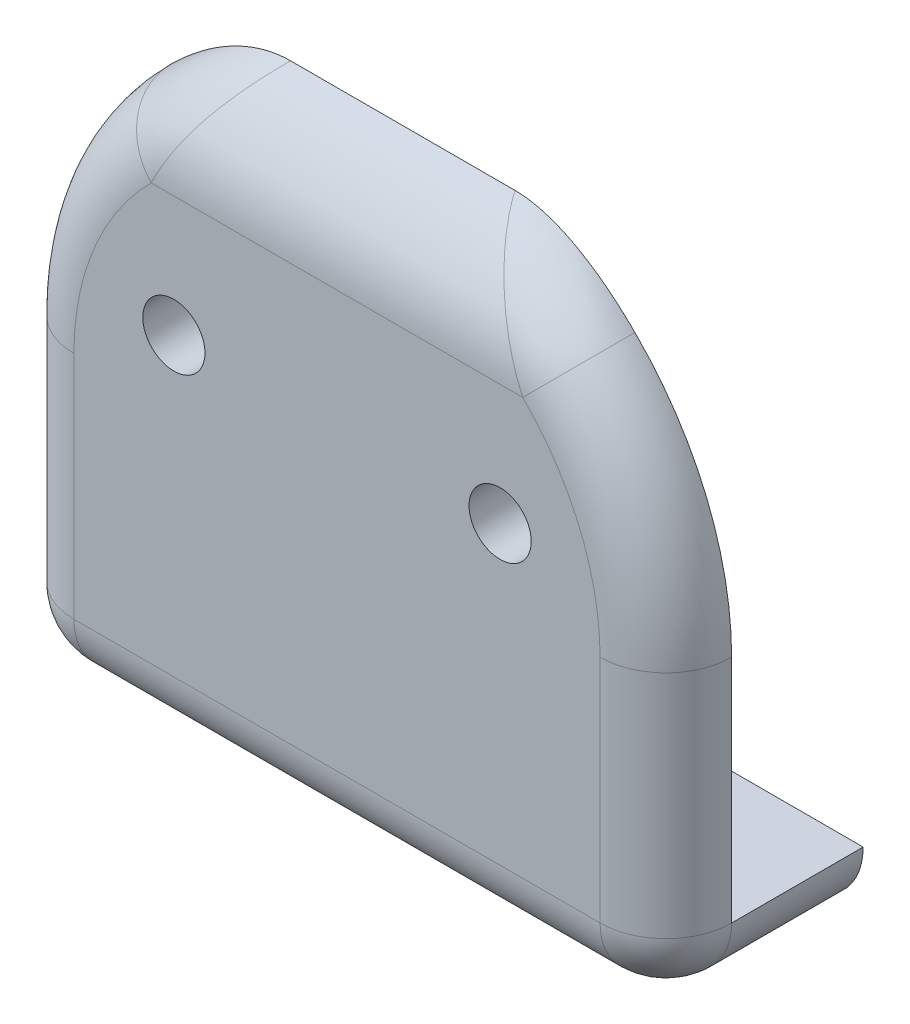
ISO-10303-21;
HEADER;
FILE_DESCRIPTION(('STEP AP214'),'2;1');
FILE_NAME('part.step','',(''),(''),'','','');
FILE_SCHEMA(('AUTOMOTIVE_DESIGN { 1 0 10303 214 1 1 1 1 }'));
ENDSEC;
DATA;
#1=APPLICATION_CONTEXT('core data for automotive mechanical design processes');
#2=APPLICATION_PROTOCOL_DEFINITION('international standard','automotive_design',2000,#1);
#3=PRODUCT_CONTEXT('',#1,'mechanical');
#4=PRODUCT('Part','Part','',(#3));
#5=PRODUCT_RELATED_PRODUCT_CATEGORY('part','',(#4));
#6=PRODUCT_DEFINITION_FORMATION('','',#4);
#7=PRODUCT_DEFINITION_CONTEXT('part definition',#1,'design');
#8=PRODUCT_DEFINITION('design','',#6,#7);
#9=PRODUCT_DEFINITION_SHAPE('','',#8);
#10=(LENGTH_UNIT() NAMED_UNIT(*) SI_UNIT(.MILLI.,.METRE.));
#11=(NAMED_UNIT(*) PLANE_ANGLE_UNIT() SI_UNIT($,.RADIAN.));
#12=(NAMED_UNIT(*) SI_UNIT($,.STERADIAN.) SOLID_ANGLE_UNIT());
#13=UNCERTAINTY_MEASURE_WITH_UNIT(LENGTH_MEASURE(1.E-05),#10,'distance_accuracy_value','');
#14=(GEOMETRIC_REPRESENTATION_CONTEXT(3) GLOBAL_UNCERTAINTY_ASSIGNED_CONTEXT((#13)) GLOBAL_UNIT_ASSIGNED_CONTEXT((#10,
#11,#12)) REPRESENTATION_CONTEXT('',''));
#15=CARTESIAN_POINT('',(0.,0.,0.));
#16=DIRECTION('',(0.,0.,1.));
#17=DIRECTION('',(1.,0.,0.));
#18=AXIS2_PLACEMENT_3D('',#15,#16,#17);
#19=CARTESIAN_POINT('',(31.75,-3.175,3.175));
#20=DIRECTION('',(0.,1.,0.));
#21=DIRECTION('',(0.,0.,1.));
#22=AXIS2_PLACEMENT_3D('',#19,#20,#21);
#23=PLANE('',#22);
#24=DIRECTION('',(0.,0.,-1.));
#25=VECTOR('',#24,1.);
#26=CARTESIAN_POINT('',(3.175,-3.175,3.175));
#27=LINE('',#26,#25);
#28=CARTESIAN_POINT('',(3.175,-3.175,0.));
#29=VERTEX_POINT('',#28);
#30=CARTESIAN_POINT('',(3.175,-3.175,-6.35));
#31=VERTEX_POINT('',#30);
#32=EDGE_CURVE('E150',#29,#31,#27,.T.);
#33=ORIENTED_EDGE('',*,*,#32,.T.);
#34=DIRECTION('',(-1.,0.,0.));
#35=VECTOR('',#34,1.);
#36=CARTESIAN_POINT('',(0.,-3.175,-6.35));
#37=LINE('',#36,#35);
#38=CARTESIAN_POINT('',(28.575,-3.175,-6.35));
#39=VERTEX_POINT('',#38);
#40=EDGE_CURVE('E76',#39,#31,#37,.T.);
#41=ORIENTED_EDGE('',*,*,#40,.F.);
#42=DIRECTION('',(0.,0.,-1.));
#43=VECTOR('',#42,1.);
#44=CARTESIAN_POINT('',(28.575,-3.175,0.));
#45=LINE('',#44,#43);
#46=CARTESIAN_POINT('',(28.575,-3.175,0.));
#47=VERTEX_POINT('',#46);
#48=EDGE_CURVE('E70',#39,#47,#45,.F.);
#49=ORIENTED_EDGE('',*,*,#48,.T.);
#50=DIRECTION('',(-1.,0.,0.));
#51=VECTOR('',#50,1.);
#52=CARTESIAN_POINT('',(31.75,-3.175,0.));
#53=LINE('',#52,#51);
#54=EDGE_CURVE('E269',#47,#29,#53,.T.);
#55=ORIENTED_EDGE('',*,*,#54,.T.);
#56=EDGE_LOOP('',(#33,#41,#49,#55));
#57=FACE_BOUND('',#56,.T.);
#58=ADVANCED_FACE('F62',(#57),#23,.F.);
#59=CARTESIAN_POINT('',(31.75,0.,-31.75));
#60=DIRECTION('',(0.,-1.,0.));
#61=DIRECTION('',(0.,0.,-1.));
#62=AXIS2_PLACEMENT_3D('',#59,#60,#61);
#63=PLANE('',#62);
#64=DIRECTION('',(0.,0.,1.));
#65=VECTOR('',#64,1.);
#66=CARTESIAN_POINT('',(31.75,0.,-31.75));
#67=LINE('',#66,#65);
#68=CARTESIAN_POINT('',(31.75,0.,-6.35));
#69=VERTEX_POINT('',#68);
#70=CARTESIAN_POINT('',(31.75,0.,0.));
#71=VERTEX_POINT('',#70);
#72=EDGE_CURVE('E329',#69,#71,#67,.T.);
#73=ORIENTED_EDGE('',*,*,#72,.F.);
#74=DIRECTION('',(-1.,0.,0.));
#75=VECTOR('',#74,1.);
#76=CARTESIAN_POINT('',(31.75,0.,-6.35));
#77=LINE('',#76,#75);
#78=CARTESIAN_POINT('',(0.,0.,-6.35));
#79=VERTEX_POINT('',#78);
#80=EDGE_CURVE('E141',#69,#79,#77,.T.);
#81=ORIENTED_EDGE('',*,*,#80,.T.);
#82=DIRECTION('',(0.,0.,1.));
#83=VECTOR('',#82,1.);
#84=CARTESIAN_POINT('',(0.,0.,-31.75));
#85=LINE('',#84,#83);
#86=CARTESIAN_POINT('',(0.,0.,0.));
#87=VERTEX_POINT('',#86);
#88=EDGE_CURVE('E334',#79,#87,#85,.T.);
#89=ORIENTED_EDGE('',*,*,#88,.T.);
#90=DIRECTION('',(-1.,0.,0.));
#91=VECTOR('',#90,1.);
#92=CARTESIAN_POINT('',(31.75,0.,0.));
#93=LINE('',#92,#91);
#94=EDGE_CURVE('E340',#71,#87,#93,.T.);
#95=ORIENTED_EDGE('',*,*,#94,.F.);
#96=EDGE_LOOP('',(#73,#81,#89,#95));
#97=FACE_BOUND('',#96,.T.);
#98=ADVANCED_FACE('F303',(#97),#63,.F.);
#99=CARTESIAN_POINT('',(31.75,25.4,3.175));
#100=DIRECTION('',(0.,0.,-1.));
#101=DIRECTION('',(0.,1.,0.));
#102=AXIS2_PLACEMENT_3D('',#99,#100,#101);
#103=PLANE('',#102);
#104=CARTESIAN_POINT('',(8.001,14.2875,3.175));
#105=DIRECTION('',(0.,0.,1.));
#106=DIRECTION('',(1.,0.,0.));
#107=AXIS2_PLACEMENT_3D('',#104,#105,#106);
#108=CIRCLE('',#107,1.5);
#109=CARTESIAN_POINT('',(9.501,14.2875,3.175));
#110=VERTEX_POINT('',#109);
#111=EDGE_CURVE('E316',#110,#110,#108,.T.);
#112=ORIENTED_EDGE('',*,*,#111,.F.);
#113=EDGE_LOOP('',(#112));
#114=FACE_BOUND('',#113,.T.);
#115=CARTESIAN_POINT('',(23.749,14.2875,3.175));
#116=DIRECTION('',(0.,0.,1.));
#117=DIRECTION('',(1.,0.,0.));
#118=AXIS2_PLACEMENT_3D('',#115,#116,#117);
#119=CIRCLE('',#118,1.5);
#120=CARTESIAN_POINT('',(25.249,14.2875,3.175));
#121=VERTEX_POINT('',#120);
#122=EDGE_CURVE('E232',#121,#121,#119,.T.);
#123=ORIENTED_EDGE('',*,*,#122,.F.);
#124=EDGE_LOOP('',(#123));
#125=FACE_BOUND('',#124,.T.);
#126=DIRECTION('',(-1.,0.,0.));
#127=VECTOR('',#126,1.);
#128=CARTESIAN_POINT('',(31.75,20.1066669290512,3.175));
#129=LINE('',#128,#127);
#130=CARTESIAN_POINT('',(24.8413237311822,20.1066669290512,3.175));
#131=VERTEX_POINT('',#130);
#132=CARTESIAN_POINT('',(6.90867626881778,20.1066669290512,3.175));
#133=VERTEX_POINT('',#132);
#134=EDGE_CURVE('E343',#131,#133,#129,.T.);
#135=ORIENTED_EDGE('',*,*,#134,.T.);
#136=CARTESIAN_POINT('',(15.875,11.1125,3.175));
#137=DIRECTION('',(0.,0.,-1.));
#138=DIRECTION('',(0.,1.,0.));
#139=AXIS2_PLACEMENT_3D('',#136,#137,#138);
#140=CIRCLE('',#139,12.7);
#141=CARTESIAN_POINT('',(3.175,11.1125,3.175));
#142=VERTEX_POINT('',#141);
#143=EDGE_CURVE('E252',#133,#142,#140,.F.);
#144=ORIENTED_EDGE('',*,*,#143,.T.);
#145=DIRECTION('',(0.,-1.,0.));
#146=VECTOR('',#145,1.);
#147=CARTESIAN_POINT('',(3.175,25.4,3.175));
#148=LINE('',#147,#146);
#149=CARTESIAN_POINT('',(3.175,0.,3.175));
#150=VERTEX_POINT('',#149);
#151=EDGE_CURVE('E256',#142,#150,#148,.T.);
#152=ORIENTED_EDGE('',*,*,#151,.T.);
#153=DIRECTION('',(-1.,0.,0.));
#154=VECTOR('',#153,1.);
#155=CARTESIAN_POINT('',(31.75,0.,3.175));
#156=LINE('',#155,#154);
#157=CARTESIAN_POINT('',(28.575,0.,3.175));
#158=VERTEX_POINT('',#157);
#159=EDGE_CURVE('E268',#150,#158,#156,.F.);
#160=ORIENTED_EDGE('',*,*,#159,.T.);
#161=DIRECTION('',(0.,-1.,0.));
#162=VECTOR('',#161,1.);
#163=CARTESIAN_POINT('',(28.575,11.1125,3.175));
#164=LINE('',#163,#162);
#165=CARTESIAN_POINT('',(28.575,11.1125,3.175));
#166=VERTEX_POINT('',#165);
#167=EDGE_CURVE('E263',#158,#166,#164,.F.);
#168=ORIENTED_EDGE('',*,*,#167,.T.);
#169=CARTESIAN_POINT('',(15.875,11.1125,3.175));
#170=DIRECTION('',(0.,0.,-1.));
#171=DIRECTION('',(0.,1.,0.));
#172=AXIS2_PLACEMENT_3D('',#169,#170,#171);
#173=CIRCLE('',#172,12.7);
#174=EDGE_CURVE('E259',#166,#131,#173,.F.);
#175=ORIENTED_EDGE('',*,*,#174,.T.);
#176=EDGE_LOOP('',(#135,#144,#152,#160,#168,#175));
#177=FACE_BOUND('',#176,.T.);
#178=ADVANCED_FACE('F272',(#114,#125,#177),#103,.F.);
#179=CARTESIAN_POINT('',(31.75,0.,0.));
#180=DIRECTION('',(0.,0.,1.));
#181=DIRECTION('',(1.,0.,0.));
#182=AXIS2_PLACEMENT_3D('',#179,#180,#181);
#183=PLANE('',#182);
#184=CARTESIAN_POINT('',(8.001,14.2875,0.));
#185=DIRECTION('',(0.,0.,1.));
#186=DIRECTION('',(1.,0.,0.));
#187=AXIS2_PLACEMENT_3D('',#184,#185,#186);
#188=CIRCLE('',#187,1.5);
#189=CARTESIAN_POINT('',(9.501,14.2875,0.));
#190=VERTEX_POINT('',#189);
#191=EDGE_CURVE('E328',#190,#190,#188,.T.);
#192=ORIENTED_EDGE('',*,*,#191,.T.);
#193=EDGE_LOOP('',(#192));
#194=FACE_BOUND('',#193,.T.);
#195=CARTESIAN_POINT('',(23.749,14.2875,0.));
#196=DIRECTION('',(0.,0.,1.));
#197=DIRECTION('',(1.,0.,0.));
#198=AXIS2_PLACEMENT_3D('',#195,#196,#197);
#199=CIRCLE('',#198,1.5);
#200=CARTESIAN_POINT('',(25.249,14.2875,0.));
#201=VERTEX_POINT('',#200);
#202=EDGE_CURVE('E336',#201,#201,#199,.T.);
#203=ORIENTED_EDGE('',*,*,#202,.T.);
#204=EDGE_LOOP('',(#203));
#205=FACE_BOUND('',#204,.T.);
#206=CARTESIAN_POINT('',(15.875,11.1125,0.));
#207=DIRECTION('',(0.,0.,1.));
#208=DIRECTION('',(1.,0.,0.));
#209=AXIS2_PLACEMENT_3D('',#206,#207,#208);
#210=CIRCLE('',#209,15.875);
#211=CARTESIAN_POINT('',(4.66709533602223,22.355208661314,0.));
#212=VERTEX_POINT('',#211);
#213=CARTESIAN_POINT('',(0.,11.1125,0.));
#214=VERTEX_POINT('',#213);
#215=EDGE_CURVE('E254',#212,#214,#210,.T.);
#216=ORIENTED_EDGE('',*,*,#215,.F.);
#217=CARTESIAN_POINT('',(6.55096495331074,19.3178849055305,3.12292593425393));
#218=CARTESIAN_POINT('',(3.99150248547352,21.6439447320108,3.43139550785692));
#219=CARTESIAN_POINT('',(4.21995619163843,21.8909775745544,-0.0245182059554404));
#220=CARTESIAN_POINT('',(6.60914852941225,19.4515171399486,3.14064054046186));
#221=CARTESIAN_POINT('',(4.1054170709904,21.770444092641,3.39539595460926));
#222=CARTESIAN_POINT('',(4.29268566176669,21.9696257124232,-0.0161775776631141));
#223=CARTESIAN_POINT('',(6.66810143931353,19.5841888768875,3.15365994562516));
#224=CARTESIAN_POINT('',(4.21917704664475,21.8933404192208,3.35551285661239));
#225=CARTESIAN_POINT('',(4.36637679914344,22.0477085575868,-0.0100476075833553));
#226=CARTESIAN_POINT('',(6.78738691002465,19.8472313240801,3.17083841651624));
#227=CARTESIAN_POINT('',(4.44440467245074,22.1302321002358,3.26963513204604));
#228=CARTESIAN_POINT('',(4.51548363753179,22.2025199978956,-0.00195941132480991));
#229=CARTESIAN_POINT('',(6.84771912225535,19.9776026012696,3.17499969640106));
#230=CARTESIAN_POINT('',(4.55590297406995,22.2443609110359,3.22373776591894));
#231=CARTESIAN_POINT('',(4.59089890281949,22.2792489267061,-1.4264689836846E-07));
#232=CARTESIAN_POINT('',(7.02514636307009,20.3532686036546,3.17500058008287));
#233=CARTESIAN_POINT('',(4.87490660690583,22.5623758754592,3.08391229489315));
#234=CARTESIAN_POINT('',(4.81268295383704,22.5003440219415,2.72553726738463E-07));
#235=CARTESIAN_POINT('',(7.14389792320845,20.5950989601572,3.15981056338296));
#236=CARTESIAN_POINT('',(5.08180268320577,22.7582337825634,2.98283427312273));
#237=CARTESIAN_POINT('',(4.96112240401083,22.6426712629891,-0.00715169310278722));
#238=CARTESIAN_POINT('',(7.38499079446316,21.0674107317866,3.10236343973724));
#239=CARTESIAN_POINT('',(5.4872436291605,23.1238160016365,2.76835277628535));
#240=CARTESIAN_POINT('',(5.26248849307877,22.9206464202203,-0.0341997135019452));
#241=CARTESIAN_POINT('',(7.50733490802167,21.297882890057,3.0600846360015));
#242=CARTESIAN_POINT('',(5.68613076280634,23.2943335427938,2.65520439921077));
#243=CARTESIAN_POINT('',(5.41541863502561,23.0562888883583,-0.0541059838171254));
#244=CARTESIAN_POINT('',(7.75509133480387,21.7469295238669,2.95107867201161));
#245=CARTESIAN_POINT('',(6.07661639241106,23.6136591672484,2.41996393045415));
#246=CARTESIAN_POINT('',(5.72511416850633,23.3205715426439,-0.105429625326912));
#247=CARTESIAN_POINT('',(7.88051217473509,21.9654637931453,2.88427411933788));
#248=CARTESIAN_POINT('',(6.26857168685935,23.763107494073,2.2979519360713));
#249=CARTESIAN_POINT('',(5.88189021842463,23.4491880657317,-0.136883435451392));
#250=CARTESIAN_POINT('',(8.13323572159676,22.3891014810646,2.72850539359607));
#251=CARTESIAN_POINT('',(6.64516101575975,24.0430781829394,2.04746109253432));
#252=CARTESIAN_POINT('',(6.1977946519968,23.6985164965928,-0.210224543839508));
#253=CARTESIAN_POINT('',(8.26053796386212,22.5942081502611,2.63954660886573));
#254=CARTESIAN_POINT('',(6.83016152888719,24.1741914089433,1.9190061986006));
#255=CARTESIAN_POINT('',(6.35692245481929,23.8192303174533,-0.252109305094065));
#256=CARTESIAN_POINT('',(8.52029504421987,22.9968228563254,2.43800769802574));
#257=CARTESIAN_POINT('',(7.19900014067105,24.4240767901961,1.65260413019252));
#258=CARTESIAN_POINT('',(6.68161880528345,24.056185847775,-0.347000542074712));
#259=CARTESIAN_POINT('',(8.65278714491819,23.1938972628974,2.32477994012063));
#260=CARTESIAN_POINT('',(7.38313648911346,24.5429552111741,1.5143558713675));
#261=CARTESIAN_POINT('',(6.84723393118365,24.1721723477496,-0.400311944424428));
#262=CARTESIAN_POINT('',(8.91819543578848,23.5731640279626,2.07751615278043));
#263=CARTESIAN_POINT('',(7.74471095971715,24.7660032398267,1.23213185011487));
#264=CARTESIAN_POINT('',(7.17899429473882,24.3953866414556,-0.516731977910839));
#265=CARTESIAN_POINT('',(9.05111164962766,23.7553555402872,1.94347894147643));
#266=CARTESIAN_POINT('',(7.92252431110249,24.8706181912512,1.0880847403897));
#267=CARTESIAN_POINT('',(7.3451395619778,24.5026139371816,-0.579841165510863));
#268=CARTESIAN_POINT('',(9.31655098945074,24.1048267450609,1.65453215640004));
#269=CARTESIAN_POINT('',(8.27169288951766,25.0670564563216,0.793361702441412));
#270=CARTESIAN_POINT('',(7.67693873687029,24.7082923035657,-0.715886942571689));
#271=CARTESIAN_POINT('',(9.44907335225418,24.2720861742104,1.49959491519162));
#272=CARTESIAN_POINT('',(8.44341052411975,25.1592403255007,0.642586523882327));
#273=CARTESIAN_POINT('',(7.84259169054852,24.8067314484308,-0.788836558780765));
#274=CARTESIAN_POINT('',(9.71219531769888,24.5909714184937,1.16799363060334));
#275=CARTESIAN_POINT('',(8.77955774401123,25.3318917343091,0.333009043523697));
#276=CARTESIAN_POINT('',(8.17149414733541,24.9944087014203,-0.944965497038058));
#277=CARTESIAN_POINT('',(9.84279595052093,24.7426058924284,0.991341741048346));
#278=CARTESIAN_POINT('',(8.9443538780301,25.412683730154,0.174120928753214));
#279=CARTESIAN_POINT('',(8.33474493817026,25.0836519056117,-1.02813909665864));
#280=CARTESIAN_POINT('',(10.0446259144277,24.9676710148427,0.694775069266105));
#281=CARTESIAN_POINT('',(9.19681779232491,25.5312144374202,-0.0846883297941325));
#282=CARTESIAN_POINT('',(8.58703239302378,25.2161121075102,-1.16777257170442));
#283=CARTESIAN_POINT('',(10.1172054293633,25.0466611082829,0.583182728874564));
#284=CARTESIAN_POINT('',(9.28677910557156,25.5723677381685,-0.180092742788469));
#285=CARTESIAN_POINT('',(8.67775678673872,25.2626010691419,-1.22031396501591));
#286=CARTESIAN_POINT('',(10.2604646073899,25.1990120386619,0.351053626144971));
#287=CARTESIAN_POINT('',(9.46330266364844,25.6511608263198,-0.375325086004179));
#288=CARTESIAN_POINT('',(8.8568307592576,25.3522659395757,-1.3296080841922));
#289=CARTESIAN_POINT('',(10.3311448355268,25.2723745621473,0.230519565053192));
#290=CARTESIAN_POINT('',(9.54993982659236,25.6888501909225,-0.475169730167737));
#291=CARTESIAN_POINT('',(8.94518104436886,25.395442840981,-1.38635953822005));
#292=CARTESIAN_POINT('',(10.4692584484667,25.4125112732347,-0.0199223081859246));
#293=CARTESIAN_POINT('',(9.71834762471181,25.7603780280049,-0.679664050390359));
#294=CARTESIAN_POINT('',(9.11782306062274,25.4779191349402,-1.50427592000565));
#295=CARTESIAN_POINT('',(10.5367117948418,25.4793297113898,-0.14975513710238));
#296=CARTESIAN_POINT('',(9.80022374404295,25.7942868063644,-0.784288638245899));
#297=CARTESIAN_POINT('',(9.20213974372885,25.5172445707788,-1.56540554316414));
#298=CARTESIAN_POINT('',(10.6675794511728,25.6061774168244,-0.421283517499122));
#299=CARTESIAN_POINT('',(9.95833475729068,25.8582924705468,-1.00038661341681));
#300=CARTESIAN_POINT('',(9.36572431414687,25.591899730775,-1.69325015557894));
#301=CARTESIAN_POINT('',(10.7309969342574,25.6662120472981,-0.562969541547158));
#302=CARTESIAN_POINT('',(10.0346614568308,25.8884375010999,-1.11188086951297));
#303=CARTESIAN_POINT('',(9.44499616786975,25.6272326113972,-1.75996065900185));
#304=CARTESIAN_POINT('',(10.8425340616613,25.769688035568,-0.837959343733751));
#305=CARTESIAN_POINT('',(10.1684101852317,25.940160270016,-1.32606581599177));
#306=CARTESIAN_POINT('',(9.58441757703587,25.6881325414734,-1.88943502446265));
#307=CARTESIAN_POINT('',(10.8915102311373,25.814263027406,-0.969233103329581));
#308=CARTESIAN_POINT('',(10.2269570708375,25.962355135724,-1.42744589959075));
#309=CARTESIAN_POINT('',(9.64563778890098,25.714366781634,-1.95124308618535));
#310=CARTESIAN_POINT('',(10.9603063465314,25.8759247952414,-1.17549973184003));
#311=CARTESIAN_POINT('',(10.3090323117584,25.9929783540986,-1.585690568118));
#312=CARTESIAN_POINT('',(9.73163293317464,25.7506573013446,-2.04836029039073));
#313=CARTESIAN_POINT('',(10.9825298751042,25.8956718291182,-1.24607830042939));
#314=CARTESIAN_POINT('',(10.335487247329,26.0027607252084,-1.63959449682342));
#315=CARTESIAN_POINT('',(9.75941234390116,25.7622792535804,-2.08159103309761));
#316=CARTESIAN_POINT('',(11.0250039349954,25.9331395008192,-1.39050452350078));
#317=CARTESIAN_POINT('',(10.3859821985335,26.0212924574831,-1.7495288109569));
#318=CARTESIAN_POINT('',(9.81250491877051,25.7843305395189,-2.14959171313176));
#319=CARTESIAN_POINT('',(11.0452518760774,25.9508574834562,-1.46435628994916));
#320=CARTESIAN_POINT('',(10.4100288574495,26.030044342435,-1.80556934737139));
#321=CARTESIAN_POINT('',(9.83781484511776,25.7947583105335,-2.18436358650987));
#322=CARTESIAN_POINT('',(11.0643124912955,25.9674253412159,-1.53988878526372));
#323=CARTESIAN_POINT('',(10.4326581957066,26.0382235730411,-1.86276460175169));
#324=CARTESIAN_POINT('',(9.86164061411936,25.8045091851401,-2.21992680306167));
#325=(BOUNDED_SURFACE() B_SPLINE_SURFACE(3,2,((#217,#218,#219),(#220,#221,#222),(#223,#224,
#225),(#226,#227,#228),(#229,#230,#231),(#232,#233,#234),(#235,#236,#237),(#238,#239,#240),
(#241,#242,#243),(#244,#245,#246),(#247,#248,#249),(#250,#251,#252),(#253,#254,#255),(#256,#257,
#258),(#259,#260,#261),(#262,#263,#264),(#265,#266,#267),(#268,#269,#270),(#271,#272,#273),
(#274,#275,#276),(#277,#278,#279),(#280,#281,#282),(#283,#284,#285),(#286,#287,#288),(#289,#290,
#291),(#292,#293,#294),(#295,#296,#297),(#298,#299,#300),(#301,#302,#303),(#304,#305,#306),
(#307,#308,#309),(#310,#311,#312),(#313,#314,#315),(#316,#317,#318),(#319,#320,#321),(#322,#323,
#324)),.UNSPECIFIED.,.F.,.F.,.F.) B_SPLINE_SURFACE_WITH_KNOTS((4,2,2,2,2,2,2,2,2,2,2,2,2,2,2,2,
2,4),(3,3),(0.,0.258232529504864,0.516400504205536,1.00967898001999,1.50335304244104,
1.99859850305049,2.4937236278221,3.00422114376089,3.51474766392168,4.02595677516628,
4.5368810512675,4.82780513730914,5.11864169184606,5.40735170256031,5.69583184171712,
5.94020939454846,6.06326282056718,6.18647547566648),(0.,1.),
.UNSPECIFIED.) GEOMETRIC_REPRESENTATION_ITEM() RATIONAL_B_SPLINE_SURFACE(((1.,0.674811651172272,
1.),(1.,0.680172623702026,1.),(1.,0.68555374898423,1.),(1.,0.696327833719102,1.),(1.,
0.701720789877095,1.),(1.,0.717397730662203,1.),(1.,0.727663253363335,1.),(1.,0.747985678073881,
1.),(1.,0.758042406177047,1.),(1.,0.777854358038292,1.),(1.,0.787608520193497,1.),(1.,
0.806690192018836,1.),(1.,0.816017804782046,1.),(1.,0.834465561615052,1.),(1.,0.843570272983622,
1.),(1.,0.861204481416164,1.),(1.,0.869733945769602,1.),(1.,0.886181642234045,1.),(1.,
0.894099041859267,1.),(1.,0.909260310892925,1.),(1.,0.916504553120519,1.),(1.,0.927295947688479,
1.),(1.,0.931091884828687,1.),(1.,0.938427090171014,1.),(1.,0.941966435254524,1.),(1.,
0.948738569347219,1.),(1.,0.951973410615627,1.),(1.,0.958123289749719,1.),(1.,0.9610385801929,
1.),(1.,0.966069515464018,1.),(1.,0.968239273168947,1.),(1.,0.971243340510667,1.),(1.,
0.97220585952312,1.),(1.,0.974032854972759,1.),(1.,0.974897202932853,1.),(1.,0.97570572459901,1.))) REPRESENTATION_ITEM('') SURFACE());
#326=CARTESIAN_POINT('',(4.66709533602223,22.355208661314,0.));
#327=CARTESIAN_POINT('',(4.74244890852174,22.4303184542147,0.));
#328=CARTESIAN_POINT('',(4.81854670187146,22.5046778597944,0.));
#329=CARTESIAN_POINT('',(4.97223735947843,22.6518379869435,0.));
#330=CARTESIAN_POINT('',(5.04983025248219,22.7246386784862,0.));
#331=CARTESIAN_POINT('',(5.28494635711472,22.9406935114402,0.));
#332=CARTESIAN_POINT('',(5.44472118366444,23.0815147291661,0.));
#333=CARTESIAN_POINT('',(5.7736408467702,23.3585382042598,0.));
#334=CARTESIAN_POINT('',(5.94290809287801,23.4945953855283,0.));
#335=CARTESIAN_POINT('',(6.28813507585845,23.7579115974678,0.));
#336=CARTESIAN_POINT('',(6.4640936694364,23.8851721207734,0.));
#337=CARTESIAN_POINT('',(6.82358867260287,24.1298562188047,0.));
#338=CARTESIAN_POINT('',(7.0071477661483,24.2472466207015,0.));
#339=CARTESIAN_POINT('',(7.38146746350365,24.4699022048502,0.));
#340=CARTESIAN_POINT('',(7.5722263502673,24.5751702541491,0.));
#341=CARTESIAN_POINT('',(7.95909389707871,24.770385502729,0.));
#342=CARTESIAN_POINT('',(8.15513044915206,24.8604747112772,0.));
#343=CARTESIAN_POINT('',(8.55413685929365,25.0237726411207,0.));
#344=CARTESIAN_POINT('',(8.75710342671847,25.0969892496425,0.));
#345=CARTESIAN_POINT('',(9.08359475741729,25.1966547388679,0.));
#346=CARTESIAN_POINT('',(9.20506054515393,25.2298912380803,0.));
#347=CARTESIAN_POINT('',(9.4498406264306,25.2883881720465,0.));
#348=CARTESIAN_POINT('',(9.57315370901792,25.3136536113315,0.));
#349=CARTESIAN_POINT('',(9.82266829305071,25.3553964214958,0.));
#350=CARTESIAN_POINT('',(9.94888660953704,25.3717757938386,0.));
#351=CARTESIAN_POINT('',(10.2024603840278,25.3940805537153,0.));
#352=CARTESIAN_POINT('',(10.3298175033962,25.3999867074835,0.));
#353=CARTESIAN_POINT('',(10.457289151771,25.4000000000003,0.));
#354=B_SPLINE_CURVE_WITH_KNOTS('',3,(#326,#327,#328,#329,#330,#331,#332,#333,#334,#335,#336,
#337,#338,#339,#340,#341,#342,#343,#344,#345,#346,#347,#348,#349,#350,#351,#352,#353),
.UNSPECIFIED.,.F.,.F.,(4,2,2,2,2,2,2,2,2,2,2,2,2,4),(0.,0.319170331609103,0.638346806089499,
1.27706327192122,1.92832669671467,2.5794793411729,3.23273959384367,3.88584502580602,
4.53245262118656,5.17875733895959,5.55632811433427,5.93366136265376,6.31507548719912,
6.697189345255),.UNSPECIFIED.);
#355=CARTESIAN_POINT('',(10.4572891517711,25.4,0.));
#356=VERTEX_POINT('',#355);
#357=EDGE_CURVE('E279',#212,#356,#354,.T.);
#358=ORIENTED_EDGE('',*,*,#357,.T.);
#359=DIRECTION('',(-1.,0.,0.));
#360=VECTOR('',#359,1.);
#361=CARTESIAN_POINT('',(31.75,25.4,0.));
#362=LINE('',#361,#360);
#363=CARTESIAN_POINT('',(21.2927108482289,25.4,0.));
#364=VERTEX_POINT('',#363);
#365=EDGE_CURVE('E333',#364,#356,#362,.T.);
#366=ORIENTED_EDGE('',*,*,#365,.F.);
#367=CARTESIAN_POINT('',(27.5300438083616,21.8909775745544,-0.0245182059554417));
#368=CARTESIAN_POINT('',(27.7584975145265,21.6439447320108,3.43139550785692));
#369=CARTESIAN_POINT('',(25.1990350466893,19.3178849055305,3.12292593425393));
#370=CARTESIAN_POINT('',(27.4573143382333,21.9696257124232,-0.016177577663115));
#371=CARTESIAN_POINT('',(27.6445829290096,21.770444092641,3.39539595460926));
#372=CARTESIAN_POINT('',(25.1408514705878,19.4515171399485,3.14064054046186));
#373=CARTESIAN_POINT('',(27.3836232008566,22.0477085575868,-0.010047607583356));
#374=CARTESIAN_POINT('',(27.5308229533553,21.8933404192207,3.3555128566124));
#375=CARTESIAN_POINT('',(25.0818985606865,19.5841888768875,3.15365994562516));
#376=CARTESIAN_POINT('',(27.2345163624682,22.2025199978956,-0.00195941132481002));
#377=CARTESIAN_POINT('',(27.3055953275493,22.1302321002358,3.26963513204604));
#378=CARTESIAN_POINT('',(24.9626130899754,19.8472313240801,3.17083841651624));
#379=CARTESIAN_POINT('',(27.1591010971805,22.2792489267061,-1.42646898339204E-07));
#380=CARTESIAN_POINT('',(27.1940970259301,22.2443609110359,3.22373776591894));
#381=CARTESIAN_POINT('',(24.9022808777447,19.9776026012696,3.17499969640106));
#382=CARTESIAN_POINT('',(26.937317046163,22.5003440219415,2.72553726682557E-07));
#383=CARTESIAN_POINT('',(26.8750933930942,22.5623758754592,3.08391229489315));
#384=CARTESIAN_POINT('',(24.7248536369299,20.3532686036546,3.17500058008287));
#385=CARTESIAN_POINT('',(26.7888775959892,22.6426712629891,-0.00715169310278758));
#386=CARTESIAN_POINT('',(26.6681973167942,22.7582337825634,2.98283427312273));
#387=CARTESIAN_POINT('',(24.6061020767916,20.5950989601572,3.15981056338296));
#388=CARTESIAN_POINT('',(26.4875115069212,22.9206464202203,-0.0341997135019455));
#389=CARTESIAN_POINT('',(26.2627563708395,23.1238160016365,2.76835277628535));
#390=CARTESIAN_POINT('',(24.3650092055368,21.0674107317866,3.10236343973724));
#391=CARTESIAN_POINT('',(26.3345813649744,23.0562888883583,-0.0541059838171254));
#392=CARTESIAN_POINT('',(26.0638692371937,23.2943335427938,2.65520439921077));
#393=CARTESIAN_POINT('',(24.2426650919783,21.297882890057,3.0600846360015));
#394=CARTESIAN_POINT('',(26.0248858314937,23.3205715426439,-0.105429625326912));
#395=CARTESIAN_POINT('',(25.6733836075889,23.6136591672484,2.41996393045415));
#396=CARTESIAN_POINT('',(23.9949086651961,21.7469295238669,2.95107867201161));
#397=CARTESIAN_POINT('',(25.8681097815754,23.4491880657317,-0.136883435451392));
#398=CARTESIAN_POINT('',(25.4814283131406,23.763107494073,2.2979519360713));
#399=CARTESIAN_POINT('',(23.8694878252649,21.9654637931453,2.88427411933788));
#400=CARTESIAN_POINT('',(25.5522053480032,23.6985164965928,-0.210224543839508));
#401=CARTESIAN_POINT('',(25.1048389842402,24.0430781829394,2.04746109253432));
#402=CARTESIAN_POINT('',(23.6167642784032,22.3891014810646,2.72850539359607));
#403=CARTESIAN_POINT('',(25.3930775451807,23.8192303174533,-0.252109305094064));
#404=CARTESIAN_POINT('',(24.9198384711128,24.1741914089433,1.9190061986006));
#405=CARTESIAN_POINT('',(23.4894620361379,22.5942081502611,2.63954660886574));
#406=CARTESIAN_POINT('',(25.0683811947165,24.056185847775,-0.347000542074712));
#407=CARTESIAN_POINT('',(24.5509998593289,24.4240767901961,1.65260413019253));
#408=CARTESIAN_POINT('',(23.2297049557801,22.9968228563254,2.43800769802574));
#409=CARTESIAN_POINT('',(24.9027660688163,24.1721723477496,-0.400311944424429));
#410=CARTESIAN_POINT('',(24.3668635108865,24.5429552111741,1.5143558713675));
#411=CARTESIAN_POINT('',(23.0972128550818,23.1938972628974,2.32477994012063));
#412=CARTESIAN_POINT('',(24.5710057052612,24.3953866414556,-0.516731977910839));
#413=CARTESIAN_POINT('',(24.0052890402828,24.7660032398267,1.23213185011487));
#414=CARTESIAN_POINT('',(22.8318045642115,23.5731640279626,2.07751615278043));
#415=CARTESIAN_POINT('',(24.4048604380222,24.5026139371816,-0.579841165510863));
#416=CARTESIAN_POINT('',(23.8274756888975,24.8706181912512,1.0880847403897));
#417=CARTESIAN_POINT('',(22.6988883503723,23.7553555402872,1.94347894147643));
#418=CARTESIAN_POINT('',(24.0730612631297,24.7082923035657,-0.715886942571688));
#419=CARTESIAN_POINT('',(23.4783071104823,25.0670564563216,0.793361702441413));
#420=CARTESIAN_POINT('',(22.4334490105493,24.1048267450609,1.65453215640004));
#421=CARTESIAN_POINT('',(23.9074083094515,24.8067314484308,-0.788836558780765));
#422=CARTESIAN_POINT('',(23.3065894758803,25.1592403255007,0.642586523882329));
#423=CARTESIAN_POINT('',(22.3009266477458,24.2720861742104,1.49959491519163));
#424=CARTESIAN_POINT('',(23.5785058526646,24.9944087014203,-0.944965497038057));
#425=CARTESIAN_POINT('',(22.9704422559888,25.3318917343091,0.333009043523699));
#426=CARTESIAN_POINT('',(22.0378046823011,24.5909714184937,1.16799363060334));
#427=CARTESIAN_POINT('',(23.4152550618297,25.0836519056117,-1.02813909665864));
#428=CARTESIAN_POINT('',(22.8056461219699,25.412683730154,0.174120928753216));
#429=CARTESIAN_POINT('',(21.9072040494791,24.7426058924284,0.991341741048349));
#430=CARTESIAN_POINT('',(23.1629676069762,25.2161121075102,-1.16777257170442));
#431=CARTESIAN_POINT('',(22.5531822076751,25.5312144374202,-0.0846883297941307));
#432=CARTESIAN_POINT('',(21.7053740855723,24.9676710148427,0.694775069266107));
#433=CARTESIAN_POINT('',(23.0722432132613,25.2626010691419,-1.22031396501591));
#434=CARTESIAN_POINT('',(22.4632208944284,25.5723677381685,-0.180092742788467));
#435=CARTESIAN_POINT('',(21.6327945706367,25.0466611082829,0.583182728874566));
#436=CARTESIAN_POINT('',(22.8931692407424,25.3522659395757,-1.3296080841922));
#437=CARTESIAN_POINT('',(22.2866973363516,25.6511608263198,-0.375325086004179));
#438=CARTESIAN_POINT('',(21.4895353926101,25.1990120386619,0.351053626144971));
#439=CARTESIAN_POINT('',(22.8048189556311,25.395442840981,-1.38635953822005));
#440=CARTESIAN_POINT('',(22.2000601734076,25.6888501909225,-0.475169730167739));
#441=CARTESIAN_POINT('',(21.4188551644732,25.2723745621473,0.23051956505319));
#442=CARTESIAN_POINT('',(22.6321769393773,25.4779191349402,-1.50427592000565));
#443=CARTESIAN_POINT('',(22.0316523752882,25.7603780280049,-0.679664050390364));
#444=CARTESIAN_POINT('',(21.2807415515333,25.4125112732347,-0.0199223081859305));
#445=CARTESIAN_POINT('',(22.5478602562712,25.5172445707788,-1.56540554316415));
#446=CARTESIAN_POINT('',(21.9497762559571,25.7942868063644,-0.784288638245904));
#447=CARTESIAN_POINT('',(21.2132882051582,25.4793297113898,-0.149755137102388));
#448=CARTESIAN_POINT('',(22.3842756858531,25.591899730775,-1.69325015557894));
#449=CARTESIAN_POINT('',(21.7916652427093,25.8582924705468,-1.00038661341682));
#450=CARTESIAN_POINT('',(21.0824205488272,25.6061774168244,-0.421283517499129));
#451=CARTESIAN_POINT('',(22.3050038321302,25.6272326113972,-1.75996065900185));
#452=CARTESIAN_POINT('',(21.7153385431692,25.8884375010999,-1.11188086951298));
#453=CARTESIAN_POINT('',(21.0190030657426,25.6662120472981,-0.562969541547161));
#454=CARTESIAN_POINT('',(22.1655824229641,25.6881325414734,-1.88943502446266));
#455=CARTESIAN_POINT('',(21.5815898147683,25.940160270016,-1.32606581599177));
#456=CARTESIAN_POINT('',(20.9074659383387,25.769688035568,-0.837959343733751));
#457=CARTESIAN_POINT('',(22.104362211099,25.714366781634,-1.95124308618535));
#458=CARTESIAN_POINT('',(21.5230429291625,25.962355135724,-1.42744589959076));
#459=CARTESIAN_POINT('',(20.8584897688627,25.814263027406,-0.969233103329582));
#460=CARTESIAN_POINT('',(22.0183670668254,25.7506573013446,-2.04836029039073));
#461=CARTESIAN_POINT('',(21.4409676882416,25.9929783540986,-1.585690568118));
#462=CARTESIAN_POINT('',(20.7896936534686,25.8759247952414,-1.17549973184003));
#463=CARTESIAN_POINT('',(21.9905876560988,25.7622792535804,-2.08159103309761));
#464=CARTESIAN_POINT('',(21.414512752671,26.0027607252084,-1.63959449682342));
#465=CARTESIAN_POINT('',(20.7674701248958,25.8956718291182,-1.24607830042939));
#466=CARTESIAN_POINT('',(21.9374950812295,25.7843305395189,-2.14959171313176));
#467=CARTESIAN_POINT('',(21.3640178014665,26.0212924574831,-1.7495288109569));
#468=CARTESIAN_POINT('',(20.7249960650046,25.9331395008192,-1.39050452350077));
#469=CARTESIAN_POINT('',(21.9121851548822,25.7947583105335,-2.18436358650986));
#470=CARTESIAN_POINT('',(21.3399711425505,26.030044342435,-1.80556934737138));
#471=CARTESIAN_POINT('',(20.7047481239226,25.9508574834562,-1.46435628994915));
#472=CARTESIAN_POINT('',(21.8883593858806,25.8045091851401,-2.21992680306166));
#473=CARTESIAN_POINT('',(21.3173418042934,26.0382235730411,-1.86276460175168));
#474=CARTESIAN_POINT('',(20.6856875087045,25.9674253412159,-1.53988878526371));
#475=(BOUNDED_SURFACE() B_SPLINE_SURFACE(3,2,((#367,#368,#369),(#370,#371,#372),(#373,#374,
#375),(#376,#377,#378),(#379,#380,#381),(#382,#383,#384),(#385,#386,#387),(#388,#389,#390),
(#391,#392,#393),(#394,#395,#396),(#397,#398,#399),(#400,#401,#402),(#403,#404,#405),(#406,#407,
#408),(#409,#410,#411),(#412,#413,#414),(#415,#416,#417),(#418,#419,#420),(#421,#422,#423),
(#424,#425,#426),(#427,#428,#429),(#430,#431,#432),(#433,#434,#435),(#436,#437,#438),(#439,#440,
#441),(#442,#443,#444),(#445,#446,#447),(#448,#449,#450),(#451,#452,#453),(#454,#455,#456),
(#457,#458,#459),(#460,#461,#462),(#463,#464,#465),(#466,#467,#468),(#469,#470,#471),(#472,#473,
#474)),.UNSPECIFIED.,.F.,.F.,.F.) B_SPLINE_SURFACE_WITH_KNOTS((4,2,2,2,2,2,2,2,2,2,2,2,2,2,2,2,
2,4),(3,3),(0.,0.258232529504867,0.516400504205545,1.00967898002,1.50335304244105,
1.9985985030505,2.49372362782211,3.00422114376089,3.51474766392169,4.02595677516628,
4.53688105126751,4.82780513730914,5.11864169184607,5.40735170256033,5.69583184171713,
5.94020939454847,6.06326282056719,6.18647547566648),(0.,1.),
.UNSPECIFIED.) GEOMETRIC_REPRESENTATION_ITEM() RATIONAL_B_SPLINE_SURFACE(((1.,0.674811651172272,
1.),(1.,0.680172623702026,1.),(1.,0.68555374898423,1.),(1.,0.696327833719102,1.),(1.,
0.701720789877095,1.),(1.,0.717397730662203,1.),(1.,0.727663253363335,1.),(1.,0.747985678073881,
1.),(1.,0.758042406177047,1.),(1.,0.777854358038292,1.),(1.,0.787608520193497,1.),(1.,
0.806690192018836,1.),(1.,0.816017804782046,1.),(1.,0.834465561615052,1.),(1.,0.843570272983621,
1.),(1.,0.861204481416164,1.),(1.,0.869733945769602,1.),(1.,0.886181642234045,1.),(1.,
0.894099041859267,1.),(1.,0.909260310892924,1.),(1.,0.916504553120519,1.),(1.,0.927295947688479,
1.),(1.,0.931091884828687,1.),(1.,0.938427090171014,1.),(1.,0.941966435254524,1.),(1.,
0.948738569347219,1.),(1.,0.951973410615628,1.),(1.,0.958123289749719,1.),(1.,0.9610385801929,
1.),(1.,0.966069515464018,1.),(1.,0.968239273168947,1.),(1.,0.971243340510667,1.),(1.,
0.97220585952312,1.),(1.,0.974032854972759,1.),(1.,0.974897202932853,1.),(1.,0.97570572459901,1.))) REPRESENTATION_ITEM('') SURFACE());
#476=CARTESIAN_POINT('',(21.2927108482289,25.4,0.));
#477=CARTESIAN_POINT('',(21.4284824081032,25.3999815375745,0.));
#478=CARTESIAN_POINT('',(21.5641088784096,25.3932849490271,0.));
#479=CARTESIAN_POINT('',(21.8339942123825,25.3680883602827,0.));
#480=CARTESIAN_POINT('',(21.9682553531519,25.3496132248794,0.));
#481=CARTESIAN_POINT('',(22.233396267734,25.3026675550292,0.));
#482=CARTESIAN_POINT('',(22.3642971268726,25.2743129318903,0.));
#483=CARTESIAN_POINT('',(22.6239482494587,25.2088013419839,0.));
#484=CARTESIAN_POINT('',(22.7526969184985,25.1716381342296,0.));
#485=CARTESIAN_POINT('',(23.095598673017,25.0613255015878,0.));
#486=CARTESIAN_POINT('',(23.3074635815848,24.9810257344439,0.));
#487=CARTESIAN_POINT('',(23.7234818081113,24.8025317458806,0.));
#488=CARTESIAN_POINT('',(23.9276314961202,24.7043292248468,0.));
#489=CARTESIAN_POINT('',(24.3300478549697,24.4920336964513,0.));
#490=CARTESIAN_POINT('',(24.5282356080922,24.3777920624305,0.));
#491=CARTESIAN_POINT('',(24.9167230997414,24.1365914849478,0.));
#492=CARTESIAN_POINT('',(25.1070211021479,24.0096297632408,0.));
#493=CARTESIAN_POINT('',(25.4547472291266,23.7628472652855,0.));
#494=CARTESIAN_POINT('',(25.6131421975054,23.6443798675162,0.));
#495=CARTESIAN_POINT('',(25.9244333367011,23.40042984456,0.));
#496=CARTESIAN_POINT('',(26.0773292352907,23.2749468728556,0.));
#497=CARTESIAN_POINT('',(26.3751935241156,23.0200717369332,0.));
#498=CARTESIAN_POINT('',(26.5202540180538,22.8907870501247,0.));
#499=CARTESIAN_POINT('',(26.7340791949665,22.6928637549754,0.));
#500=CARTESIAN_POINT('',(26.8047153586268,22.6262345592756,0.));
#501=CARTESIAN_POINT('',(26.9447428924751,22.4916817002018,0.));
#502=CARTESIAN_POINT('',(27.01413427261,22.4237580471805,0.));
#503=CARTESIAN_POINT('',(27.0829047094094,22.3552086160245,0.));
#504=B_SPLINE_CURVE_WITH_KNOTS('',3,(#476,#477,#478,#479,#480,#481,#482,#483,#484,#485,#486,
#487,#488,#489,#490,#491,#492,#493,#494,#495,#496,#497,#498,#499,#500,#501,#502,#503),
.UNSPECIFIED.,.F.,.F.,(4,2,2,2,2,2,2,2,2,2,2,2,2,4),(0.,0.406942002521415,0.81302777255129,
1.21450121275565,1.61625995644106,2.29488339840499,2.97382225007201,3.65952816943952,
4.3453841844298,4.93856051249829,5.53176616502668,6.11454522346078,6.40583900751401,
6.69713046284598),.UNSPECIFIED.);
#505=CARTESIAN_POINT('',(27.0829046639778,22.355208661314,0.));
#506=VERTEX_POINT('',#505);
#507=EDGE_CURVE('E280',#364,#506,#504,.T.);
#508=ORIENTED_EDGE('',*,*,#507,.T.);
#509=CARTESIAN_POINT('',(15.875,11.1125,0.));
#510=DIRECTION('',(0.,0.,1.));
#511=DIRECTION('',(1.,0.,0.));
#512=AXIS2_PLACEMENT_3D('',#509,#510,#511);
#513=CIRCLE('',#512,15.875);
#514=CARTESIAN_POINT('',(31.75,11.1125,0.));
#515=VERTEX_POINT('',#514);
#516=EDGE_CURVE('E321',#515,#506,#513,.T.);
#517=ORIENTED_EDGE('',*,*,#516,.F.);
#518=DIRECTION('',(0.,1.,0.));
#519=VECTOR('',#518,1.);
#520=CARTESIAN_POINT('',(31.75,0.,0.));
#521=LINE('',#520,#519);
#522=EDGE_CURVE('E331',#71,#515,#521,.T.);
#523=ORIENTED_EDGE('',*,*,#522,.F.);
#524=ORIENTED_EDGE('',*,*,#94,.T.);
#525=DIRECTION('',(0.,1.,0.));
#526=VECTOR('',#525,1.);
#527=CARTESIAN_POINT('',(0.,0.,0.));
#528=LINE('',#527,#526);
#529=EDGE_CURVE('E255',#87,#214,#528,.T.);
#530=ORIENTED_EDGE('',*,*,#529,.T.);
#531=EDGE_LOOP('',(#216,#358,#366,#508,#517,#523,#524,#530));
#532=FACE_BOUND('',#531,.T.);
#533=ADVANCED_FACE('F296',(#194,#205,#532),#183,.F.);
#534=CARTESIAN_POINT('',(31.75,20.1066669290512,-2.825));
#535=DIRECTION('',(-1.,0.,0.));
#536=DIRECTION('',(0.,0.,1.));
#537=AXIS2_PLACEMENT_3D('',#534,#535,#536);
#538=CYLINDRICAL_SURFACE('',#537,6.);
#539=ORIENTED_EDGE('',*,*,#365,.T.);
#540=CARTESIAN_POINT('',(11.0643124912955,25.9674253412159,-1.53988878526372));
#541=CARTESIAN_POINT('',(11.0452518760774,25.9508574834562,-1.46435628994916));
#542=CARTESIAN_POINT('',(11.0250039349954,25.9331395008192,-1.39050452350078));
#543=CARTESIAN_POINT('',(10.9825298751042,25.8956718291182,-1.24607830042939));
#544=CARTESIAN_POINT('',(10.9603063465314,25.8759247952414,-1.17549973184003));
#545=CARTESIAN_POINT('',(10.8915102311373,25.814263027406,-0.969233103329581));
#546=CARTESIAN_POINT('',(10.8425340616613,25.769688035568,-0.837959343733751));
#547=CARTESIAN_POINT('',(10.7309969342574,25.6662120472981,-0.562969541547159));
#548=CARTESIAN_POINT('',(10.6675794511728,25.6061774168244,-0.421283517499122));
#549=CARTESIAN_POINT('',(10.5367117948418,25.4793297113898,-0.14975513710238));
#550=CARTESIAN_POINT('',(10.4692584484667,25.4125112732347,-0.0199223081859246));
#551=CARTESIAN_POINT('',(10.3311448355268,25.2723745621473,0.230519565053191));
#552=CARTESIAN_POINT('',(10.2604646073899,25.1990120386619,0.351053626144971));
#553=CARTESIAN_POINT('',(10.1172054293633,25.0466611082829,0.583182728874564));
#554=CARTESIAN_POINT('',(10.0446259144277,24.9676710148427,0.694775069266105));
#555=CARTESIAN_POINT('',(9.84279595052093,24.7426058924284,0.991341741048346));
#556=CARTESIAN_POINT('',(9.71219531769888,24.5909714184937,1.16799363060334));
#557=CARTESIAN_POINT('',(9.44907335225418,24.2720861742104,1.49959491519162));
#558=CARTESIAN_POINT('',(9.31655098945074,24.1048267450609,1.65453215640004));
#559=CARTESIAN_POINT('',(9.05111164962766,23.7553555402872,1.94347894147643));
#560=CARTESIAN_POINT('',(8.91819543578848,23.5731640279626,2.07751615278043));
#561=CARTESIAN_POINT('',(8.65278714491819,23.1938972628974,2.32477994012063));
#562=CARTESIAN_POINT('',(8.52029504421987,22.9968228563254,2.43800769802574));
#563=CARTESIAN_POINT('',(8.26053796386212,22.5942081502611,2.63954660886573));
#564=CARTESIAN_POINT('',(8.13323572159676,22.3891014810646,2.72850539359607));
#565=CARTESIAN_POINT('',(7.88051217473509,21.9654637931453,2.88427411933788));
#566=CARTESIAN_POINT('',(7.75509133480387,21.7469295238669,2.95107867201161));
#567=CARTESIAN_POINT('',(7.50733490802167,21.297882890057,3.0600846360015));
#568=CARTESIAN_POINT('',(7.38499079446316,21.0674107317866,3.10236343973724));
#569=CARTESIAN_POINT('',(7.14389792320845,20.5950989601572,3.15981056338296));
#570=CARTESIAN_POINT('',(7.02514636307009,20.3532686036546,3.17500058008287));
#571=CARTESIAN_POINT('',(6.84771912225535,19.9776026012696,3.17499969640106));
#572=CARTESIAN_POINT('',(6.78738691002465,19.8472313240801,3.17083841651624));
#573=CARTESIAN_POINT('',(6.66810143931353,19.5841888768875,3.15365994562516));
#574=CARTESIAN_POINT('',(6.60914852941225,19.4515171399485,3.14064054046186));
#575=CARTESIAN_POINT('',(6.55096495331074,19.3178849055305,3.12292593425393));
#576=B_SPLINE_CURVE_WITH_KNOTS('',3,(#540,#541,#542,#543,#544,#545,#546,#547,#548,#549,#550,
#551,#552,#553,#554,#555,#556,#557,#558,#559,#560,#561,#562,#563,#564,#565,#566,#567,#568,#569,
#570,#571,#572,#573,#574,#575),.UNSPECIFIED.,.F.,.F.,(4,2,2,2,2,2,2,2,2,2,2,2,2,2,2,2,2,4),(0.,
0.123212655099301,0.246266081118016,0.49064363394936,0.779123773106165,1.06783378382042,
1.35867033835734,1.64959442439898,2.1605187005002,2.6717278117448,3.18225433190559,
3.69275184784438,4.18787697261599,4.68312243322544,5.17679649564649,5.67007497146094,
5.92824294616161,6.18647547566648),.UNSPECIFIED.);
#577=EDGE_CURVE('E354',#356,#133,#576,.T.);
#578=ORIENTED_EDGE('',*,*,#577,.T.);
#579=ORIENTED_EDGE('',*,*,#134,.F.);
#580=CARTESIAN_POINT('',(25.1990350466893,19.3178849055305,3.12292593425393));
#581=CARTESIAN_POINT('',(25.1408514705878,19.4515171399485,3.14064054046186));
#582=CARTESIAN_POINT('',(25.0818985606865,19.5841888768875,3.15365994562516));
#583=CARTESIAN_POINT('',(24.9626130899754,19.8472313240801,3.17083841651624));
#584=CARTESIAN_POINT('',(24.9022808777447,19.9776026012696,3.17499969640106));
#585=CARTESIAN_POINT('',(24.7248536369299,20.3532686036546,3.17500058008287));
#586=CARTESIAN_POINT('',(24.6061020767916,20.5950989601572,3.15981056338296));
#587=CARTESIAN_POINT('',(24.3650092055368,21.0674107317866,3.10236343973724));
#588=CARTESIAN_POINT('',(24.2426650919783,21.297882890057,3.0600846360015));
#589=CARTESIAN_POINT('',(23.9949086651961,21.7469295238669,2.95107867201161));
#590=CARTESIAN_POINT('',(23.8694878252649,21.9654637931453,2.88427411933788));
#591=CARTESIAN_POINT('',(23.6167642784032,22.3891014810646,2.72850539359607));
#592=CARTESIAN_POINT('',(23.4894620361379,22.5942081502611,2.63954660886574));
#593=CARTESIAN_POINT('',(23.2297049557801,22.9968228563254,2.43800769802574));
#594=CARTESIAN_POINT('',(23.0972128550818,23.1938972628974,2.32477994012063));
#595=CARTESIAN_POINT('',(22.8318045642115,23.5731640279626,2.07751615278043));
#596=CARTESIAN_POINT('',(22.6988883503723,23.7553555402872,1.94347894147643));
#597=CARTESIAN_POINT('',(22.4334490105493,24.1048267450609,1.65453215640004));
#598=CARTESIAN_POINT('',(22.3009266477458,24.2720861742104,1.49959491519163));
#599=CARTESIAN_POINT('',(22.0378046823011,24.5909714184937,1.16799363060334));
#600=CARTESIAN_POINT('',(21.9072040494791,24.7426058924284,0.991341741048349));
#601=CARTESIAN_POINT('',(21.7053740855723,24.9676710148427,0.694775069266107));
#602=CARTESIAN_POINT('',(21.6327945706367,25.0466611082829,0.583182728874566));
#603=CARTESIAN_POINT('',(21.4895353926101,25.1990120386619,0.351053626144971));
#604=CARTESIAN_POINT('',(21.4188551644732,25.2723745621473,0.23051956505319));
#605=CARTESIAN_POINT('',(21.2807415515333,25.4125112732347,-0.0199223081859307));
#606=CARTESIAN_POINT('',(21.2132882051582,25.4793297113898,-0.149755137102388));
#607=CARTESIAN_POINT('',(21.0824205488272,25.6061774168244,-0.421283517499129));
#608=CARTESIAN_POINT('',(21.0190030657426,25.6662120472981,-0.56296954154716));
#609=CARTESIAN_POINT('',(20.9074659383387,25.769688035568,-0.837959343733751));
#610=CARTESIAN_POINT('',(20.8584897688627,25.814263027406,-0.969233103329583));
#611=CARTESIAN_POINT('',(20.7896936534686,25.8759247952414,-1.17549973184003));
#612=CARTESIAN_POINT('',(20.7674701248958,25.8956718291182,-1.24607830042939));
#613=CARTESIAN_POINT('',(20.7249960650046,25.9331395008192,-1.39050452350077));
#614=CARTESIAN_POINT('',(20.7047481239226,25.9508574834562,-1.46435628994915));
#615=CARTESIAN_POINT('',(20.6856875087045,25.9674253412159,-1.53988878526371));
#616=B_SPLINE_CURVE_WITH_KNOTS('',3,(#580,#581,#582,#583,#584,#585,#586,#587,#588,#589,#590,
#591,#592,#593,#594,#595,#596,#597,#598,#599,#600,#601,#602,#603,#604,#605,#606,#607,#608,#609,
#610,#611,#612,#613,#614,#615),.UNSPECIFIED.,.F.,.F.,(4,2,2,2,2,2,2,2,2,2,2,2,2,2,2,2,2,4),(0.,
0.258232529504867,0.516400504205545,1.00967898002,1.50335304244105,1.9985985030505,
2.49372362782211,3.00422114376089,3.51474766392169,4.02595677516628,4.53688105126751,
4.82780513730914,5.11864169184607,5.40735170256033,5.69583184171713,5.94020939454847,
6.06326282056719,6.18647547566648),.UNSPECIFIED.);
#617=EDGE_CURVE('E274',#131,#364,#616,.T.);
#618=ORIENTED_EDGE('',*,*,#617,.T.);
#619=EDGE_LOOP('',(#539,#578,#579,#618));
#620=FACE_BOUND('',#619,.T.);
#621=ADVANCED_FACE('F216',(#620),#538,.T.);
#622=CARTESIAN_POINT('',(8.001,14.2875,-31.75));
#623=DIRECTION('',(0.,0.,1.));
#624=DIRECTION('',(1.,0.,0.));
#625=AXIS2_PLACEMENT_3D('',#622,#623,#624);
#626=CYLINDRICAL_SURFACE('',#625,1.5);
#627=ORIENTED_EDGE('',*,*,#111,.T.);
#628=EDGE_LOOP('',(#627));
#629=FACE_BOUND('',#628,.T.);
#630=ORIENTED_EDGE('',*,*,#191,.F.);
#631=EDGE_LOOP('',(#630));
#632=FACE_BOUND('',#631,.T.);
#633=ADVANCED_FACE('F302',(#629,#632),#626,.F.);
#634=CARTESIAN_POINT('',(23.749,14.2875,-31.75));
#635=DIRECTION('',(0.,0.,1.));
#636=DIRECTION('',(1.,0.,0.));
#637=AXIS2_PLACEMENT_3D('',#634,#635,#636);
#638=CYLINDRICAL_SURFACE('',#637,1.5);
#639=ORIENTED_EDGE('',*,*,#122,.T.);
#640=EDGE_LOOP('',(#639));
#641=FACE_BOUND('',#640,.T.);
#642=ORIENTED_EDGE('',*,*,#202,.F.);
#643=EDGE_LOOP('',(#642));
#644=FACE_BOUND('',#643,.T.);
#645=ADVANCED_FACE('F362',(#641,#644),#638,.F.);
#646=CARTESIAN_POINT('',(31.75,0.,0.));
#647=DIRECTION('',(-1.,0.,0.));
#648=DIRECTION('',(0.,0.,1.));
#649=AXIS2_PLACEMENT_3D('',#646,#647,#648);
#650=CYLINDRICAL_SURFACE('',#649,3.175);
#651=ORIENTED_EDGE('',*,*,#159,.F.);
#652=CARTESIAN_POINT('',(3.175,0.,0.));
#653=DIRECTION('',(-1.,0.,0.));
#654=DIRECTION('',(0.,0.,1.));
#655=AXIS2_PLACEMENT_3D('',#652,#653,#654);
#656=CIRCLE('',#655,3.175);
#657=EDGE_CURVE('E84',#150,#29,#656,.F.);
#658=ORIENTED_EDGE('',*,*,#657,.T.);
#659=ORIENTED_EDGE('',*,*,#54,.F.);
#660=CARTESIAN_POINT('',(28.575,0.,0.));
#661=DIRECTION('',(-1.,0.,0.));
#662=DIRECTION('',(0.,0.,1.));
#663=AXIS2_PLACEMENT_3D('',#660,#661,#662);
#664=CIRCLE('',#663,3.175);
#665=EDGE_CURVE('E261',#47,#158,#664,.T.);
#666=ORIENTED_EDGE('',*,*,#665,.T.);
#667=EDGE_LOOP('',(#651,#658,#659,#666));
#668=FACE_BOUND('',#667,.T.);
#669=ADVANCED_FACE('F211',(#668),#650,.T.);
#670=ORIENTED_EDGE('',*,*,#507,.F.);
#671=ORIENTED_EDGE('',*,*,#617,.F.);
#672=CARTESIAN_POINT('',(24.8413237311822,20.1066669290512,0.));
#673=DIRECTION('',(0.708202120397733,-0.706009742612774,0.));
#674=DIRECTION('',(0.706009742612774,0.708202120397733,0.));
#675=AXIS2_PLACEMENT_3D('',#672,#673,#674);
#676=CIRCLE('',#675,3.175);
#677=EDGE_CURVE('E229',#506,#131,#676,.T.);
#678=ORIENTED_EDGE('',*,*,#677,.F.);
#679=EDGE_LOOP('',(#670,#671,#678));
#680=FACE_BOUND('',#679,.T.);
#681=ADVANCED_FACE('F205',(#680),#475,.T.);
#682=CARTESIAN_POINT('',(15.875,11.1125,0.));
#683=DIRECTION('',(0.,0.,-1.));
#684=DIRECTION('',(0.,1.,0.));
#685=AXIS2_PLACEMENT_3D('',#682,#683,#684);
#686=TOROIDAL_SURFACE('',#685,12.7,3.175);
#687=ORIENTED_EDGE('',*,*,#677,.T.);
#688=ORIENTED_EDGE('',*,*,#174,.F.);
#689=CARTESIAN_POINT('',(28.575,11.1125,0.));
#690=DIRECTION('',(0.,-1.,0.));
#691=DIRECTION('',(0.,0.,-1.));
#692=AXIS2_PLACEMENT_3D('',#689,#690,#691);
#693=CIRCLE('',#692,3.175);
#694=EDGE_CURVE('E233',#515,#166,#693,.T.);
#695=ORIENTED_EDGE('',*,*,#694,.F.);
#696=ORIENTED_EDGE('',*,*,#516,.T.);
#697=EDGE_LOOP('',(#687,#688,#695,#696));
#698=FACE_BOUND('',#697,.T.);
#699=ADVANCED_FACE('F201',(#698),#686,.T.);
#700=CARTESIAN_POINT('',(28.575,0.,0.));
#701=DIRECTION('',(0.,1.,0.));
#702=DIRECTION('',(0.,0.,1.));
#703=AXIS2_PLACEMENT_3D('',#700,#701,#702);
#704=CYLINDRICAL_SURFACE('',#703,3.175);
#705=ORIENTED_EDGE('',*,*,#694,.T.);
#706=ORIENTED_EDGE('',*,*,#167,.F.);
#707=CARTESIAN_POINT('',(28.575,0.,0.));
#708=DIRECTION('',(0.,-1.,0.));
#709=DIRECTION('',(0.,0.,-1.));
#710=AXIS2_PLACEMENT_3D('',#707,#708,#709);
#711=CIRCLE('',#710,3.175);
#712=EDGE_CURVE('E236',#71,#158,#711,.T.);
#713=ORIENTED_EDGE('',*,*,#712,.F.);
#714=ORIENTED_EDGE('',*,*,#522,.T.);
#715=EDGE_LOOP('',(#705,#706,#713,#714));
#716=FACE_BOUND('',#715,.T.);
#717=ADVANCED_FACE('F197',(#716),#704,.T.);
#718=CARTESIAN_POINT('',(28.575,0.,0.));
#719=DIRECTION('',(1.,0.,0.));
#720=DIRECTION('',(0.,0.,-1.));
#721=AXIS2_PLACEMENT_3D('',#718,#719,#720);
#722=SPHERICAL_SURFACE('',#721,3.175);
#723=ORIENTED_EDGE('',*,*,#712,.T.);
#724=ORIENTED_EDGE('',*,*,#665,.F.);
#725=CARTESIAN_POINT('',(28.575,0.,0.));
#726=DIRECTION('',(0.,0.,-1.));
#727=DIRECTION('',(-1.,0.,0.));
#728=AXIS2_PLACEMENT_3D('',#725,#726,#727);
#729=CIRCLE('',#728,3.175);
#730=EDGE_CURVE('E155',#71,#47,#729,.T.);
#731=ORIENTED_EDGE('',*,*,#730,.F.);
#732=EDGE_LOOP('',(#723,#724,#731));
#733=FACE_BOUND('',#732,.T.);
#734=ADVANCED_FACE('F194',(#733),#722,.T.);
#735=CARTESIAN_POINT('',(28.575,0.,0.));
#736=DIRECTION('',(0.,0.,1.));
#737=DIRECTION('',(1.,0.,0.));
#738=AXIS2_PLACEMENT_3D('',#735,#736,#737);
#739=CYLINDRICAL_SURFACE('',#738,3.175);
#740=CARTESIAN_POINT('',(28.575,0.,-6.35));
#741=DIRECTION('',(0.,0.,1.));
#742=DIRECTION('',(1.,0.,0.));
#743=AXIS2_PLACEMENT_3D('',#740,#741,#742);
#744=CIRCLE('',#743,3.175);
#745=EDGE_CURVE('E138',#69,#39,#744,.F.);
#746=ORIENTED_EDGE('',*,*,#745,.F.);
#747=ORIENTED_EDGE('',*,*,#72,.T.);
#748=ORIENTED_EDGE('',*,*,#730,.T.);
#749=ORIENTED_EDGE('',*,*,#48,.F.);
#750=EDGE_LOOP('',(#746,#747,#748,#749));
#751=FACE_BOUND('',#750,.T.);
#752=ADVANCED_FACE('F153',(#751),#739,.T.);
#753=CARTESIAN_POINT('',(3.175,0.,3.175));
#754=DIRECTION('',(0.,0.,-1.));
#755=DIRECTION('',(-1.,0.,0.));
#756=AXIS2_PLACEMENT_3D('',#753,#754,#755);
#757=CYLINDRICAL_SURFACE('',#756,3.175);
#758=CARTESIAN_POINT('',(3.175,0.,-6.35));
#759=DIRECTION('',(0.,0.,1.));
#760=DIRECTION('',(1.,0.,0.));
#761=AXIS2_PLACEMENT_3D('',#758,#759,#760);
#762=CIRCLE('',#761,3.175);
#763=EDGE_CURVE('E12',#31,#79,#762,.F.);
#764=ORIENTED_EDGE('',*,*,#763,.F.);
#765=ORIENTED_EDGE('',*,*,#32,.F.);
#766=CARTESIAN_POINT('',(3.175,0.,0.));
#767=DIRECTION('',(0.,0.,1.));
#768=DIRECTION('',(1.,0.,0.));
#769=AXIS2_PLACEMENT_3D('',#766,#767,#768);
#770=CIRCLE('',#769,3.175);
#771=EDGE_CURVE('E240',#87,#29,#770,.T.);
#772=ORIENTED_EDGE('',*,*,#771,.F.);
#773=ORIENTED_EDGE('',*,*,#88,.F.);
#774=EDGE_LOOP('',(#764,#765,#772,#773));
#775=FACE_BOUND('',#774,.T.);
#776=ADVANCED_FACE('F187',(#775),#757,.T.);
#777=CARTESIAN_POINT('',(3.175,0.,0.));
#778=DIRECTION('',(1.,0.,0.));
#779=DIRECTION('',(0.,0.,-1.));
#780=AXIS2_PLACEMENT_3D('',#777,#778,#779);
#781=SPHERICAL_SURFACE('',#780,3.175);
#782=ORIENTED_EDGE('',*,*,#771,.T.);
#783=ORIENTED_EDGE('',*,*,#657,.F.);
#784=CARTESIAN_POINT('',(3.175,0.,0.));
#785=DIRECTION('',(0.,1.,0.));
#786=DIRECTION('',(0.,0.,1.));
#787=AXIS2_PLACEMENT_3D('',#784,#785,#786);
#788=CIRCLE('',#787,3.175);
#789=EDGE_CURVE('E242',#87,#150,#788,.T.);
#790=ORIENTED_EDGE('',*,*,#789,.F.);
#791=EDGE_LOOP('',(#782,#783,#790));
#792=FACE_BOUND('',#791,.T.);
#793=ADVANCED_FACE('F183',(#792),#781,.T.);
#794=CARTESIAN_POINT('',(3.175,25.4,0.));
#795=DIRECTION('',(0.,-1.,0.));
#796=DIRECTION('',(0.,0.,-1.));
#797=AXIS2_PLACEMENT_3D('',#794,#795,#796);
#798=CYLINDRICAL_SURFACE('',#797,3.175);
#799=ORIENTED_EDGE('',*,*,#789,.T.);
#800=ORIENTED_EDGE('',*,*,#151,.F.);
#801=CARTESIAN_POINT('',(3.175,11.1125,0.));
#802=DIRECTION('',(0.,1.,0.));
#803=DIRECTION('',(0.,0.,1.));
#804=AXIS2_PLACEMENT_3D('',#801,#802,#803);
#805=CIRCLE('',#804,3.175);
#806=EDGE_CURVE('E161',#214,#142,#805,.T.);
#807=ORIENTED_EDGE('',*,*,#806,.F.);
#808=ORIENTED_EDGE('',*,*,#529,.F.);
#809=EDGE_LOOP('',(#799,#800,#807,#808));
#810=FACE_BOUND('',#809,.T.);
#811=ADVANCED_FACE('F179',(#810),#798,.T.);
#812=CARTESIAN_POINT('',(15.875,11.1125,0.));
#813=DIRECTION('',(0.,0.,-1.));
#814=DIRECTION('',(0.,1.,0.));
#815=AXIS2_PLACEMENT_3D('',#812,#813,#814);
#816=TOROIDAL_SURFACE('',#815,12.7,3.175);
#817=ORIENTED_EDGE('',*,*,#806,.T.);
#818=ORIENTED_EDGE('',*,*,#143,.F.);
#819=CARTESIAN_POINT('',(6.90867626881778,20.1066669290512,0.));
#820=DIRECTION('',(0.708202120397734,0.706009742612773,0.));
#821=DIRECTION('',(-0.706009742612773,0.708202120397734,0.));
#822=AXIS2_PLACEMENT_3D('',#819,#820,#821);
#823=CIRCLE('',#822,3.175);
#824=EDGE_CURVE('E145',#212,#133,#823,.T.);
#825=ORIENTED_EDGE('',*,*,#824,.F.);
#826=ORIENTED_EDGE('',*,*,#215,.T.);
#827=EDGE_LOOP('',(#817,#818,#825,#826));
#828=FACE_BOUND('',#827,.T.);
#829=ADVANCED_FACE('F175',(#828),#816,.T.);
#830=ORIENTED_EDGE('',*,*,#577,.F.);
#831=ORIENTED_EDGE('',*,*,#357,.F.);
#832=ORIENTED_EDGE('',*,*,#824,.T.);
#833=EDGE_LOOP('',(#830,#831,#832));
#834=FACE_BOUND('',#833,.T.);
#835=ADVANCED_FACE('F178',(#834),#325,.T.);
#836=CARTESIAN_POINT('',(0.,25.8539892735811,-6.35));
#837=DIRECTION('',(0.,0.,1.));
#838=DIRECTION('',(1.,0.,0.));
#839=AXIS2_PLACEMENT_3D('',#836,#837,#838);
#840=PLANE('',#839);
#841=ORIENTED_EDGE('',*,*,#745,.T.);
#842=ORIENTED_EDGE('',*,*,#40,.T.);
#843=ORIENTED_EDGE('',*,*,#763,.T.);
#844=ORIENTED_EDGE('',*,*,#80,.F.);
#845=EDGE_LOOP('',(#841,#842,#843,#844));
#846=FACE_BOUND('',#845,.T.);
#847=ADVANCED_FACE('F139',(#846),#840,.F.);
#848=CLOSED_SHELL('',(#58,#98,#178,#533,#621,#633,#645,#669,#681,#699,#717,#734,#752,#776,#793,
#811,#829,#835,#847));
#849=MANIFOLD_SOLID_BREP('B2',#848);
#850=ADVANCED_BREP_SHAPE_REPRESENTATION('',(#18,#849),#14);
#851=SHAPE_DEFINITION_REPRESENTATION(#9,#850);
ENDSEC;
END-ISO-10303-21;
